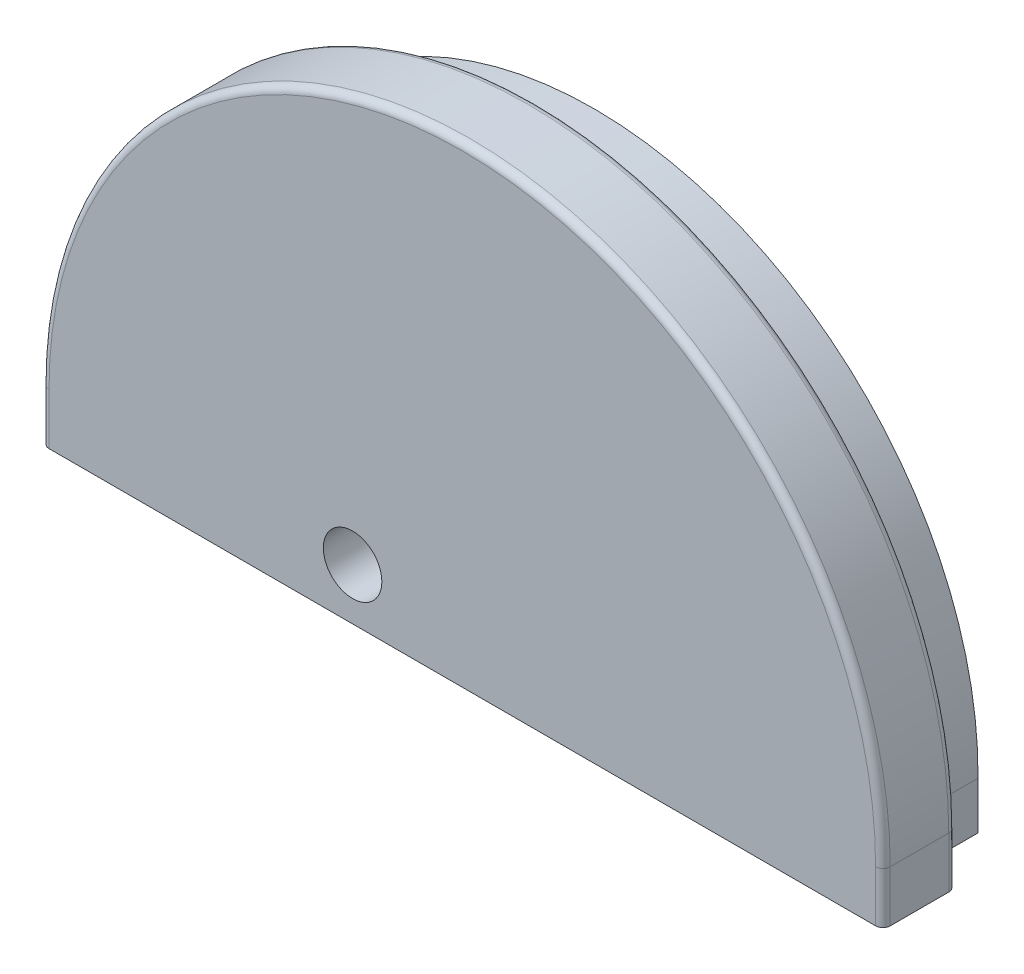
ISO-10303-21;
HEADER;
FILE_DESCRIPTION(('STEP AP214'),'2;1');
FILE_NAME('part.step','',(''),(''),'','','');
FILE_SCHEMA(('AUTOMOTIVE_DESIGN { 1 0 10303 214 1 1 1 1 }'));
ENDSEC;
DATA;
#1=APPLICATION_CONTEXT('core data for automotive mechanical design processes');
#2=APPLICATION_PROTOCOL_DEFINITION('international standard','automotive_design',2000,#1);
#3=PRODUCT_CONTEXT('',#1,'mechanical');
#4=PRODUCT('Part','Part','',(#3));
#5=PRODUCT_RELATED_PRODUCT_CATEGORY('part','',(#4));
#6=PRODUCT_DEFINITION_FORMATION('','',#4);
#7=PRODUCT_DEFINITION_CONTEXT('part definition',#1,'design');
#8=PRODUCT_DEFINITION('design','',#6,#7);
#9=PRODUCT_DEFINITION_SHAPE('','',#8);
#10=(LENGTH_UNIT() NAMED_UNIT(*) SI_UNIT(.MILLI.,.METRE.));
#11=(NAMED_UNIT(*) PLANE_ANGLE_UNIT() SI_UNIT($,.RADIAN.));
#12=(NAMED_UNIT(*) SI_UNIT($,.STERADIAN.) SOLID_ANGLE_UNIT());
#13=UNCERTAINTY_MEASURE_WITH_UNIT(LENGTH_MEASURE(1.E-05),#10,'distance_accuracy_value','');
#14=(GEOMETRIC_REPRESENTATION_CONTEXT(3) GLOBAL_UNCERTAINTY_ASSIGNED_CONTEXT((#13)) GLOBAL_UNIT_ASSIGNED_CONTEXT((#10,
#11,#12)) REPRESENTATION_CONTEXT('',''));
#15=CARTESIAN_POINT('',(0.,0.,0.));
#16=DIRECTION('',(0.,0.,1.));
#17=DIRECTION('',(1.,0.,0.));
#18=AXIS2_PLACEMENT_3D('',#15,#16,#17);
#19=CARTESIAN_POINT('',(49.7401472728543,48.7881442927304,8.));
#20=DIRECTION('',(0.,1.,0.));
#21=DIRECTION('',(0.,0.,1.));
#22=AXIS2_PLACEMENT_3D('',#19,#20,#21);
#23=PLANE('',#22);
#24=DIRECTION('',(0.,0.,-1.));
#25=VECTOR('',#24,1.);
#26=CARTESIAN_POINT('',(72.3917820401487,48.7881442927304,4.5));
#27=LINE('',#26,#25);
#28=CARTESIAN_POINT('',(72.3917820401487,48.7881442927304,2.5));
#29=VERTEX_POINT('',#28);
#30=CARTESIAN_POINT('',(72.3917820401487,48.7881442927304,2.));
#31=VERTEX_POINT('',#30);
#32=EDGE_CURVE('E356',#29,#31,#27,.T.);
#33=ORIENTED_EDGE('',*,*,#32,.T.);
#34=CARTESIAN_POINT('',(74.3917820401487,48.7881442927304,2.));
#35=DIRECTION('',(0.,1.,0.));
#36=DIRECTION('',(0.,0.,1.));
#37=AXIS2_PLACEMENT_3D('',#34,#35,#36);
#38=CIRCLE('',#37,2.);
#39=CARTESIAN_POINT('',(74.3917820401487,48.7881442927304,0.));
#40=VERTEX_POINT('',#39);
#41=EDGE_CURVE('E315',#31,#40,#38,.F.);
#42=ORIENTED_EDGE('',*,*,#41,.T.);
#43=DIRECTION('',(1.,0.,0.));
#44=VECTOR('',#43,1.);
#45=CARTESIAN_POINT('',(49.7401472728543,48.7881442927304,0.));
#46=LINE('',#45,#44);
#47=CARTESIAN_POINT('',(154.737534778382,48.7881442927304,0.));
#48=VERTEX_POINT('',#47);
#49=EDGE_CURVE('E214',#40,#48,#46,.T.);
#50=ORIENTED_EDGE('',*,*,#49,.T.);
#51=DIRECTION('',(0.,0.,-1.));
#52=VECTOR('',#51,1.);
#53=CARTESIAN_POINT('',(154.737534778382,48.7881442927304,8.));
#54=LINE('',#53,#52);
#55=CARTESIAN_POINT('',(154.737534778382,48.7881442927304,8.));
#56=VERTEX_POINT('',#55);
#57=EDGE_CURVE('E222',#56,#48,#54,.T.);
#58=ORIENTED_EDGE('',*,*,#57,.F.);
#59=DIRECTION('',(1.,0.,0.));
#60=VECTOR('',#59,1.);
#61=CARTESIAN_POINT('',(159.740147272854,48.7881442927297,8.));
#62=LINE('',#61,#60);
#63=CARTESIAN_POINT('',(158.740147272854,48.7881442927297,8.));
#64=VERTEX_POINT('',#63);
#65=EDGE_CURVE('E184',#56,#64,#62,.T.);
#66=ORIENTED_EDGE('',*,*,#65,.T.);
#67=CARTESIAN_POINT('',(158.740147272854,48.7881442927304,9.));
#68=DIRECTION('',(0.,1.,0.));
#69=DIRECTION('',(0.,0.,1.));
#70=AXIS2_PLACEMENT_3D('',#67,#68,#69);
#71=CIRCLE('',#70,1.);
#72=CARTESIAN_POINT('',(159.740147272854,48.7881442927297,9.));
#73=VERTEX_POINT('',#72);
#74=EDGE_CURVE('E637',#64,#73,#71,.F.);
#75=ORIENTED_EDGE('',*,*,#74,.T.);
#76=DIRECTION('',(0.,0.,-1.));
#77=VECTOR('',#76,1.);
#78=CARTESIAN_POINT('',(159.740147272854,48.7881442927297,18.));
#79=LINE('',#78,#77);
#80=CARTESIAN_POINT('',(159.740147272854,48.7881442927297,17.));
#81=VERTEX_POINT('',#80);
#82=EDGE_CURVE('E253',#81,#73,#79,.T.);
#83=ORIENTED_EDGE('',*,*,#82,.F.);
#84=CARTESIAN_POINT('',(158.740147272854,48.7881442927304,17.));
#85=DIRECTION('',(0.,1.,0.));
#86=DIRECTION('',(0.,0.,1.));
#87=AXIS2_PLACEMENT_3D('',#84,#85,#86);
#88=CIRCLE('',#87,1.);
#89=CARTESIAN_POINT('',(158.740147272854,48.7881442927297,18.));
#90=VERTEX_POINT('',#89);
#91=EDGE_CURVE('E278',#81,#90,#88,.F.);
#92=ORIENTED_EDGE('',*,*,#91,.T.);
#93=DIRECTION('',(1.,0.,0.));
#94=VECTOR('',#93,1.);
#95=CARTESIAN_POINT('',(159.740147272854,48.7881442927297,18.));
#96=LINE('',#95,#94);
#97=CARTESIAN_POINT('',(45.7401472728544,48.7881442927297,18.));
#98=VERTEX_POINT('',#97);
#99=EDGE_CURVE('E183',#98,#90,#96,.T.);
#100=ORIENTED_EDGE('',*,*,#99,.F.);
#101=CARTESIAN_POINT('',(45.7401472728544,48.7881442927304,17.));
#102=DIRECTION('',(0.,1.,0.));
#103=DIRECTION('',(0.,0.,1.));
#104=AXIS2_PLACEMENT_3D('',#101,#102,#103);
#105=CIRCLE('',#104,1.);
#106=CARTESIAN_POINT('',(44.7401472728544,48.7881442927297,17.));
#107=VERTEX_POINT('',#106);
#108=EDGE_CURVE('E652',#98,#107,#105,.F.);
#109=ORIENTED_EDGE('',*,*,#108,.T.);
#110=DIRECTION('',(0.,0.,-1.));
#111=VECTOR('',#110,1.);
#112=CARTESIAN_POINT('',(44.7401472728544,48.7881442927297,18.));
#113=LINE('',#112,#111);
#114=CARTESIAN_POINT('',(44.7401472728544,48.7881442927297,9.));
#115=VERTEX_POINT('',#114);
#116=EDGE_CURVE('E251',#107,#115,#113,.T.);
#117=ORIENTED_EDGE('',*,*,#116,.T.);
#118=CARTESIAN_POINT('',(45.7401472728544,48.7881442927304,9.));
#119=DIRECTION('',(0.,1.,0.));
#120=DIRECTION('',(0.,0.,1.));
#121=AXIS2_PLACEMENT_3D('',#118,#119,#120);
#122=CIRCLE('',#121,1.);
#123=CARTESIAN_POINT('',(45.7401472728544,48.7881442927297,8.));
#124=VERTEX_POINT('',#123);
#125=EDGE_CURVE('E179',#115,#124,#122,.F.);
#126=ORIENTED_EDGE('',*,*,#125,.T.);
#127=CARTESIAN_POINT('',(49.7401472728543,48.7881442927297,8.));
#128=VERTEX_POINT('',#127);
#129=EDGE_CURVE('E171',#124,#128,#62,.T.);
#130=ORIENTED_EDGE('',*,*,#129,.T.);
#131=DIRECTION('',(0.,0.,-1.));
#132=VECTOR('',#131,1.);
#133=CARTESIAN_POINT('',(49.7401472728543,48.7881442927304,8.));
#134=LINE('',#133,#132);
#135=CARTESIAN_POINT('',(49.7401472728543,48.7881442927304,0.));
#136=VERTEX_POINT('',#135);
#137=EDGE_CURVE('E175',#128,#136,#134,.T.);
#138=ORIENTED_EDGE('',*,*,#137,.T.);
#139=CARTESIAN_POINT('',(55.3917820401487,48.7881442927304,0.));
#140=VERTEX_POINT('',#139);
#141=EDGE_CURVE('E211',#136,#140,#46,.T.);
#142=ORIENTED_EDGE('',*,*,#141,.T.);
#143=CARTESIAN_POINT('',(55.3917820401487,48.7881442927304,2.));
#144=DIRECTION('',(0.,1.,0.));
#145=DIRECTION('',(0.,0.,1.));
#146=AXIS2_PLACEMENT_3D('',#143,#144,#145);
#147=CIRCLE('',#146,2.);
#148=CARTESIAN_POINT('',(57.3917820401487,48.7881442927304,2.));
#149=VERTEX_POINT('',#148);
#150=EDGE_CURVE('E313',#140,#149,#147,.F.);
#151=ORIENTED_EDGE('',*,*,#150,.T.);
#152=DIRECTION('',(0.,0.,-1.));
#153=VECTOR('',#152,1.);
#154=CARTESIAN_POINT('',(57.3917820401487,48.7881442927304,4.5));
#155=LINE('',#154,#153);
#156=CARTESIAN_POINT('',(57.3917820401487,48.7881442927304,2.5));
#157=VERTEX_POINT('',#156);
#158=EDGE_CURVE('E360',#157,#149,#155,.T.);
#159=ORIENTED_EDGE('',*,*,#158,.F.);
#160=CARTESIAN_POINT('',(59.3917820401487,48.7881442927304,2.5));
#161=DIRECTION('',(0.,1.,0.));
#162=DIRECTION('',(0.,0.,1.));
#163=AXIS2_PLACEMENT_3D('',#160,#161,#162);
#164=CIRCLE('',#163,2.);
#165=CARTESIAN_POINT('',(59.3917820401487,48.7881442927304,4.5));
#166=VERTEX_POINT('',#165);
#167=EDGE_CURVE('E43',#157,#166,#164,.T.);
#168=ORIENTED_EDGE('',*,*,#167,.T.);
#169=DIRECTION('',(1.,0.,0.));
#170=VECTOR('',#169,1.);
#171=CARTESIAN_POINT('',(72.3917820401487,48.7881442927304,4.5));
#172=LINE('',#171,#170);
#173=CARTESIAN_POINT('',(70.3917820401487,48.7881442927304,4.5));
#174=VERTEX_POINT('',#173);
#175=EDGE_CURVE('E335',#166,#174,#172,.T.);
#176=ORIENTED_EDGE('',*,*,#175,.T.);
#177=CARTESIAN_POINT('',(70.3917820401487,48.7881442927304,2.5));
#178=DIRECTION('',(0.,1.,0.));
#179=DIRECTION('',(0.,0.,1.));
#180=AXIS2_PLACEMENT_3D('',#177,#178,#179);
#181=CIRCLE('',#180,2.);
#182=EDGE_CURVE('E11',#174,#29,#181,.T.);
#183=ORIENTED_EDGE('',*,*,#182,.T.);
#184=EDGE_LOOP('',(#33,#42,#50,#58,#66,#75,#83,#92,#100,#109,#117,#126,#130,#138,#142,#151,#159,
#168,#176,#183));
#185=FACE_BOUND('',#184,.T.);
#186=ADVANCED_FACE('F34',(#185),#23,.F.);
#187=CARTESIAN_POINT('',(102.240147272854,55.7881442927283,0.));
#188=DIRECTION('',(0.,0.,-1.));
#189=DIRECTION('',(-1.,0.,0.));
#190=AXIS2_PLACEMENT_3D('',#187,#188,#189);
#191=PLANE('',#190);
#192=ORIENTED_EDGE('',*,*,#49,.F.);
#193=DIRECTION('',(0.,1.,0.));
#194=VECTOR('',#193,1.);
#195=CARTESIAN_POINT('',(74.3917820401487,55.7881442927283,0.));
#196=LINE('',#195,#194);
#197=CARTESIAN_POINT('',(74.3917820401487,58.7546680660623,0.));
#198=VERTEX_POINT('',#197);
#199=EDGE_CURVE('E306',#40,#198,#196,.T.);
#200=ORIENTED_EDGE('',*,*,#199,.T.);
#201=CARTESIAN_POINT('',(64.8917820401487,58.7546680660623,0.));
#202=DIRECTION('',(0.,0.,-1.));
#203=DIRECTION('',(-1.,0.,0.));
#204=AXIS2_PLACEMENT_3D('',#201,#202,#203);
#205=CIRCLE('',#204,9.49999999999998);
#206=CARTESIAN_POINT('',(55.3917820401487,58.7546680660623,0.));
#207=VERTEX_POINT('',#206);
#208=EDGE_CURVE('E291',#198,#207,#205,.F.);
#209=ORIENTED_EDGE('',*,*,#208,.T.);
#210=DIRECTION('',(0.,-1.,0.));
#211=VECTOR('',#210,1.);
#212=CARTESIAN_POINT('',(55.3917820401487,55.7881442927283,0.));
#213=LINE('',#212,#211);
#214=EDGE_CURVE('E304',#207,#140,#213,.T.);
#215=ORIENTED_EDGE('',*,*,#214,.T.);
#216=ORIENTED_EDGE('',*,*,#141,.F.);
#217=DIRECTION('',(0.,-1.,0.));
#218=VECTOR('',#217,1.);
#219=CARTESIAN_POINT('',(49.7401472728543,55.7881442927283,0.));
#220=LINE('',#219,#218);
#221=CARTESIAN_POINT('',(49.7401472728543,55.7881442927283,0.));
#222=VERTEX_POINT('',#221);
#223=EDGE_CURVE('E193',#222,#136,#220,.T.);
#224=ORIENTED_EDGE('',*,*,#223,.F.);
#225=CARTESIAN_POINT('',(102.240147272854,55.7881442927283,0.));
#226=DIRECTION('',(0.,0.,1.));
#227=DIRECTION('',(-1.,0.,0.));
#228=AXIS2_PLACEMENT_3D('',#225,#226,#227);
#229=CIRCLE('',#228,52.5);
#230=CARTESIAN_POINT('',(154.737534778382,55.2644028541581,0.));
#231=VERTEX_POINT('',#230);
#232=EDGE_CURVE('E216',#231,#222,#229,.T.);
#233=ORIENTED_EDGE('',*,*,#232,.F.);
#234=DIRECTION('',(0.,1.,0.));
#235=VECTOR('',#234,1.);
#236=CARTESIAN_POINT('',(154.737534778382,48.7881442927304,0.));
#237=LINE('',#236,#235);
#238=EDGE_CURVE('E213',#48,#231,#237,.T.);
#239=ORIENTED_EDGE('',*,*,#238,.F.);
#240=EDGE_LOOP('',(#192,#200,#209,#215,#216,#224,#233,#239));
#241=FACE_BOUND('',#240,.T.);
#242=CARTESIAN_POINT('',(87.2401472728543,55.7881442927304,0.));
#243=DIRECTION('',(0.,0.,-1.));
#244=DIRECTION('',(-1.,0.,0.));
#245=AXIS2_PLACEMENT_3D('',#242,#243,#244);
#246=CIRCLE('',#245,4.00000000000001);
#247=CARTESIAN_POINT('',(83.2401472728543,55.7881442927304,0.));
#248=VERTEX_POINT('',#247);
#249=EDGE_CURVE('E298',#248,#248,#246,.F.);
#250=ORIENTED_EDGE('',*,*,#249,.T.);
#251=EDGE_LOOP('',(#250));
#252=FACE_BOUND('',#251,.T.);
#253=ADVANCED_FACE('F369',(#241,#252),#191,.T.);
#254=CARTESIAN_POINT('',(154.737534778382,48.7881442927304,8.));
#255=DIRECTION('',(-1.,0.,0.));
#256=DIRECTION('',(0.,0.,1.));
#257=AXIS2_PLACEMENT_3D('',#254,#255,#256);
#258=PLANE('',#257);
#259=ORIENTED_EDGE('',*,*,#238,.T.);
#260=DIRECTION('',(0.,0.,-1.));
#261=VECTOR('',#260,1.);
#262=CARTESIAN_POINT('',(154.737534778382,55.2644028541581,8.));
#263=LINE('',#262,#261);
#264=CARTESIAN_POINT('',(154.737534778382,55.2644028541581,8.));
#265=VERTEX_POINT('',#264);
#266=EDGE_CURVE('E220',#265,#231,#263,.T.);
#267=ORIENTED_EDGE('',*,*,#266,.F.);
#268=DIRECTION('',(0.,1.,0.));
#269=VECTOR('',#268,1.);
#270=CARTESIAN_POINT('',(154.737534778382,48.7881442927304,8.));
#271=LINE('',#270,#269);
#272=EDGE_CURVE('E201',#56,#265,#271,.T.);
#273=ORIENTED_EDGE('',*,*,#272,.F.);
#274=ORIENTED_EDGE('',*,*,#57,.T.);
#275=EDGE_LOOP('',(#259,#267,#273,#274));
#276=FACE_BOUND('',#275,.T.);
#277=ADVANCED_FACE('F391',(#276),#258,.F.);
#278=CARTESIAN_POINT('',(102.240147272854,55.7881442927283,8.));
#279=DIRECTION('',(0.,0.,-1.));
#280=DIRECTION('',(-1.,0.,0.));
#281=AXIS2_PLACEMENT_3D('',#278,#279,#280);
#282=CYLINDRICAL_SURFACE('',#281,52.5);
#283=ORIENTED_EDGE('',*,*,#232,.T.);
#284=DIRECTION('',(0.,0.,-1.));
#285=VECTOR('',#284,1.);
#286=CARTESIAN_POINT('',(49.7401472728543,55.7881442927283,8.));
#287=LINE('',#286,#285);
#288=CARTESIAN_POINT('',(49.7401472728543,55.7881442927283,8.));
#289=VERTEX_POINT('',#288);
#290=EDGE_CURVE('E194',#289,#222,#287,.T.);
#291=ORIENTED_EDGE('',*,*,#290,.F.);
#292=CARTESIAN_POINT('',(102.240147272854,55.7881442927283,8.));
#293=DIRECTION('',(0.,0.,1.));
#294=DIRECTION('',(-1.,0.,0.));
#295=AXIS2_PLACEMENT_3D('',#292,#293,#294);
#296=CIRCLE('',#295,52.5);
#297=EDGE_CURVE('E199',#265,#289,#296,.T.);
#298=ORIENTED_EDGE('',*,*,#297,.F.);
#299=ORIENTED_EDGE('',*,*,#266,.T.);
#300=EDGE_LOOP('',(#283,#291,#298,#299));
#301=FACE_BOUND('',#300,.T.);
#302=ADVANCED_FACE('F554',(#301),#282,.T.);
#303=CARTESIAN_POINT('',(49.7401472728543,55.7881442927283,8.));
#304=DIRECTION('',(1.,0.,0.));
#305=DIRECTION('',(0.,0.,-1.));
#306=AXIS2_PLACEMENT_3D('',#303,#304,#305);
#307=PLANE('',#306);
#308=ORIENTED_EDGE('',*,*,#223,.T.);
#309=ORIENTED_EDGE('',*,*,#137,.F.);
#310=DIRECTION('',(0.,-1.,0.));
#311=VECTOR('',#310,1.);
#312=CARTESIAN_POINT('',(49.7401472728543,55.7881442927283,8.));
#313=LINE('',#312,#311);
#314=EDGE_CURVE('E190',#289,#128,#313,.T.);
#315=ORIENTED_EDGE('',*,*,#314,.F.);
#316=ORIENTED_EDGE('',*,*,#290,.T.);
#317=EDGE_LOOP('',(#308,#309,#315,#316));
#318=FACE_BOUND('',#317,.T.);
#319=ADVANCED_FACE('F188',(#318),#307,.F.);
#320=CARTESIAN_POINT('',(44.7401472728544,55.7881442927304,18.));
#321=DIRECTION('',(1.,0.,0.));
#322=DIRECTION('',(0.,0.,-1.));
#323=AXIS2_PLACEMENT_3D('',#320,#321,#322);
#324=PLANE('',#323);
#325=DIRECTION('',(0.,0.,-1.));
#326=VECTOR('',#325,1.);
#327=CARTESIAN_POINT('',(44.7401472728544,55.7881442927304,18.));
#328=LINE('',#327,#326);
#329=CARTESIAN_POINT('',(44.7401472728544,55.7881442927304,17.));
#330=VERTEX_POINT('',#329);
#331=CARTESIAN_POINT('',(44.7401472728544,55.7881442927304,9.));
#332=VERTEX_POINT('',#331);
#333=EDGE_CURVE('E245',#330,#332,#328,.T.);
#334=ORIENTED_EDGE('',*,*,#333,.T.);
#335=DIRECTION('',(0.,-1.,0.));
#336=VECTOR('',#335,1.);
#337=CARTESIAN_POINT('',(44.7401472728544,48.7881442927297,9.));
#338=LINE('',#337,#336);
#339=EDGE_CURVE('E644',#332,#115,#338,.T.);
#340=ORIENTED_EDGE('',*,*,#339,.T.);
#341=ORIENTED_EDGE('',*,*,#116,.F.);
#342=DIRECTION('',(0.,-1.,0.));
#343=VECTOR('',#342,1.);
#344=CARTESIAN_POINT('',(44.7401472728544,55.7881442927304,17.));
#345=LINE('',#344,#343);
#346=EDGE_CURVE('E642',#107,#330,#345,.F.);
#347=ORIENTED_EDGE('',*,*,#346,.T.);
#348=EDGE_LOOP('',(#334,#340,#341,#347));
#349=FACE_BOUND('',#348,.T.);
#350=ADVANCED_FACE('F533',(#349),#324,.F.);
#351=CARTESIAN_POINT('',(159.740147272854,55.7881442927304,18.));
#352=DIRECTION('',(-1.,0.,0.));
#353=DIRECTION('',(0.,0.,1.));
#354=AXIS2_PLACEMENT_3D('',#351,#352,#353);
#355=PLANE('',#354);
#356=ORIENTED_EDGE('',*,*,#82,.T.);
#357=DIRECTION('',(0.,1.,0.));
#358=VECTOR('',#357,1.);
#359=CARTESIAN_POINT('',(159.740147272854,55.7881442927304,9.));
#360=LINE('',#359,#358);
#361=CARTESIAN_POINT('',(159.740147272854,55.7881442927304,9.));
#362=VERTEX_POINT('',#361);
#363=EDGE_CURVE('E230',#73,#362,#360,.T.);
#364=ORIENTED_EDGE('',*,*,#363,.T.);
#365=DIRECTION('',(0.,0.,-1.));
#366=VECTOR('',#365,1.);
#367=CARTESIAN_POINT('',(159.740147272854,55.7881442927304,18.));
#368=LINE('',#367,#366);
#369=CARTESIAN_POINT('',(159.740147272854,55.7881442927304,17.));
#370=VERTEX_POINT('',#369);
#371=EDGE_CURVE('E255',#370,#362,#368,.T.);
#372=ORIENTED_EDGE('',*,*,#371,.F.);
#373=DIRECTION('',(0.,1.,0.));
#374=VECTOR('',#373,1.);
#375=CARTESIAN_POINT('',(159.740147272854,55.7881442927304,17.));
#376=LINE('',#375,#374);
#377=EDGE_CURVE('E226',#370,#81,#376,.F.);
#378=ORIENTED_EDGE('',*,*,#377,.T.);
#379=EDGE_LOOP('',(#356,#364,#372,#378));
#380=FACE_BOUND('',#379,.T.);
#381=ADVANCED_FACE('F524',(#380),#355,.F.);
#382=CARTESIAN_POINT('',(102.240147272854,55.7881442927304,18.));
#383=DIRECTION('',(0.,0.,-1.));
#384=DIRECTION('',(-1.,0.,0.));
#385=AXIS2_PLACEMENT_3D('',#382,#383,#384);
#386=CYLINDRICAL_SURFACE('',#385,57.5);
#387=ORIENTED_EDGE('',*,*,#371,.T.);
#388=CARTESIAN_POINT('',(102.240147272854,55.7881442927304,9.));
#389=DIRECTION('',(0.,0.,-1.));
#390=DIRECTION('',(-1.,0.,0.));
#391=AXIS2_PLACEMENT_3D('',#388,#389,#390);
#392=CIRCLE('',#391,57.5);
#393=EDGE_CURVE('E284',#362,#332,#392,.F.);
#394=ORIENTED_EDGE('',*,*,#393,.T.);
#395=ORIENTED_EDGE('',*,*,#333,.F.);
#396=CARTESIAN_POINT('',(102.240147272854,55.7881442927304,17.));
#397=DIRECTION('',(0.,0.,-1.));
#398=DIRECTION('',(-1.,0.,0.));
#399=AXIS2_PLACEMENT_3D('',#396,#397,#398);
#400=CIRCLE('',#399,57.5);
#401=EDGE_CURVE('E282',#330,#370,#400,.T.);
#402=ORIENTED_EDGE('',*,*,#401,.T.);
#403=EDGE_LOOP('',(#387,#394,#395,#402));
#404=FACE_BOUND('',#403,.T.);
#405=ADVANCED_FACE('F516',(#404),#386,.T.);
#406=CARTESIAN_POINT('',(102.240147272854,55.7881442927304,18.));
#407=DIRECTION('',(0.,0.,-1.));
#408=DIRECTION('',(-1.,0.,0.));
#409=AXIS2_PLACEMENT_3D('',#406,#407,#408);
#410=PLANE('',#409);
#411=ORIENTED_EDGE('',*,*,#99,.T.);
#412=DIRECTION('',(0.,1.,0.));
#413=VECTOR('',#412,1.);
#414=CARTESIAN_POINT('',(158.740147272854,55.7881442927304,18.));
#415=LINE('',#414,#413);
#416=CARTESIAN_POINT('',(158.740147272854,55.7881442927304,18.));
#417=VERTEX_POINT('',#416);
#418=EDGE_CURVE('E270',#90,#417,#415,.T.);
#419=ORIENTED_EDGE('',*,*,#418,.T.);
#420=CARTESIAN_POINT('',(102.240147272854,55.7881442927304,18.));
#421=DIRECTION('',(0.,0.,-1.));
#422=DIRECTION('',(-1.,0.,0.));
#423=AXIS2_PLACEMENT_3D('',#420,#421,#422);
#424=CIRCLE('',#423,56.5);
#425=CARTESIAN_POINT('',(45.7401472728544,55.7881442927304,18.));
#426=VERTEX_POINT('',#425);
#427=EDGE_CURVE('E286',#417,#426,#424,.F.);
#428=ORIENTED_EDGE('',*,*,#427,.T.);
#429=DIRECTION('',(0.,-1.,0.));
#430=VECTOR('',#429,1.);
#431=CARTESIAN_POINT('',(45.7401472728544,55.7881442927304,18.));
#432=LINE('',#431,#430);
#433=EDGE_CURVE('E272',#426,#98,#432,.T.);
#434=ORIENTED_EDGE('',*,*,#433,.T.);
#435=EDGE_LOOP('',(#411,#419,#428,#434));
#436=FACE_BOUND('',#435,.T.);
#437=CARTESIAN_POINT('',(87.2401472728543,55.7881442927304,18.));
#438=DIRECTION('',(0.,0.,1.));
#439=DIRECTION('',(1.,0.,0.));
#440=AXIS2_PLACEMENT_3D('',#437,#438,#439);
#441=CIRCLE('',#440,4.00000000000001);
#442=CARTESIAN_POINT('',(91.2401472728543,55.7881442927304,18.));
#443=VERTEX_POINT('',#442);
#444=EDGE_CURVE('E250',#443,#443,#441,.T.);
#445=ORIENTED_EDGE('',*,*,#444,.F.);
#446=EDGE_LOOP('',(#445));
#447=FACE_BOUND('',#446,.T.);
#448=ADVANCED_FACE('F268',(#436,#447),#410,.F.);
#449=CARTESIAN_POINT('',(102.240147272854,55.7881442927304,8.));
#450=DIRECTION('',(0.,0.,-1.));
#451=DIRECTION('',(-1.,0.,0.));
#452=AXIS2_PLACEMENT_3D('',#449,#450,#451);
#453=PLANE('',#452);
#454=CARTESIAN_POINT('',(102.240147272854,55.7881442927304,8.));
#455=DIRECTION('',(0.,0.,-1.));
#456=DIRECTION('',(-1.,0.,0.));
#457=AXIS2_PLACEMENT_3D('',#454,#455,#456);
#458=CIRCLE('',#457,56.5);
#459=CARTESIAN_POINT('',(45.7401472728544,55.7881442927304,8.));
#460=VERTEX_POINT('',#459);
#461=CARTESIAN_POINT('',(158.740147272854,55.7881442927304,8.));
#462=VERTEX_POINT('',#461);
#463=EDGE_CURVE('E237',#460,#462,#458,.T.);
#464=ORIENTED_EDGE('',*,*,#463,.T.);
#465=DIRECTION('',(0.,1.,0.));
#466=VECTOR('',#465,1.);
#467=CARTESIAN_POINT('',(158.740147272854,48.7881442927297,8.));
#468=LINE('',#467,#466);
#469=EDGE_CURVE('E640',#462,#64,#468,.F.);
#470=ORIENTED_EDGE('',*,*,#469,.T.);
#471=ORIENTED_EDGE('',*,*,#65,.F.);
#472=ORIENTED_EDGE('',*,*,#272,.T.);
#473=ORIENTED_EDGE('',*,*,#297,.T.);
#474=ORIENTED_EDGE('',*,*,#314,.T.);
#475=ORIENTED_EDGE('',*,*,#129,.F.);
#476=DIRECTION('',(0.,-1.,0.));
#477=VECTOR('',#476,1.);
#478=CARTESIAN_POINT('',(45.7401472728544,55.7881442927304,8.));
#479=LINE('',#478,#477);
#480=EDGE_CURVE('E655',#124,#460,#479,.F.);
#481=ORIENTED_EDGE('',*,*,#480,.T.);
#482=EDGE_LOOP('',(#464,#470,#471,#472,#473,#474,#475,#481));
#483=FACE_BOUND('',#482,.T.);
#484=ADVANCED_FACE('F196',(#483),#453,.T.);
#485=CARTESIAN_POINT('',(87.2401472728543,55.7881442927304,-500000.));
#486=DIRECTION('',(0.,0.,1.));
#487=DIRECTION('',(1.,0.,0.));
#488=AXIS2_PLACEMENT_3D('',#485,#486,#487);
#489=CYLINDRICAL_SURFACE('',#488,4.00000000000001);
#490=ORIENTED_EDGE('',*,*,#444,.T.);
#491=EDGE_LOOP('',(#490));
#492=FACE_BOUND('',#491,.T.);
#493=ORIENTED_EDGE('',*,*,#249,.F.);
#494=EDGE_LOOP('',(#493));
#495=FACE_BOUND('',#494,.T.);
#496=ADVANCED_FACE('F371',(#492,#495),#489,.F.);
#497=CARTESIAN_POINT('',(45.7401472728544,55.7881442927304,9.));
#498=DIRECTION('',(0.,1.,0.));
#499=DIRECTION('',(0.,0.,1.));
#500=AXIS2_PLACEMENT_3D('',#497,#498,#499);
#501=CYLINDRICAL_SURFACE('',#500,1.);
#502=ORIENTED_EDGE('',*,*,#125,.F.);
#503=ORIENTED_EDGE('',*,*,#339,.F.);
#504=CARTESIAN_POINT('',(45.7401472728544,55.7881442927304,9.));
#505=DIRECTION('',(0.,1.,0.));
#506=DIRECTION('',(0.,0.,1.));
#507=AXIS2_PLACEMENT_3D('',#504,#505,#506);
#508=CIRCLE('',#507,1.);
#509=EDGE_CURVE('E294',#460,#332,#508,.T.);
#510=ORIENTED_EDGE('',*,*,#509,.F.);
#511=ORIENTED_EDGE('',*,*,#480,.F.);
#512=EDGE_LOOP('',(#502,#503,#510,#511));
#513=FACE_BOUND('',#512,.T.);
#514=ADVANCED_FACE('F373',(#513),#501,.T.);
#515=CARTESIAN_POINT('',(102.240147272854,55.7881442927304,9.));
#516=DIRECTION('',(0.,0.,-1.));
#517=DIRECTION('',(-1.,0.,0.));
#518=AXIS2_PLACEMENT_3D('',#515,#516,#517);
#519=TOROIDAL_SURFACE('',#518,56.5,1.);
#520=ORIENTED_EDGE('',*,*,#509,.T.);
#521=ORIENTED_EDGE('',*,*,#393,.F.);
#522=CARTESIAN_POINT('',(158.740147272854,55.7881442927304,9.));
#523=DIRECTION('',(0.,-1.,0.));
#524=DIRECTION('',(0.,0.,-1.));
#525=AXIS2_PLACEMENT_3D('',#522,#523,#524);
#526=CIRCLE('',#525,1.);
#527=EDGE_CURVE('E292',#462,#362,#526,.T.);
#528=ORIENTED_EDGE('',*,*,#527,.F.);
#529=ORIENTED_EDGE('',*,*,#463,.F.);
#530=EDGE_LOOP('',(#520,#521,#528,#529));
#531=FACE_BOUND('',#530,.T.);
#532=ADVANCED_FACE('F380',(#531),#519,.T.);
#533=CARTESIAN_POINT('',(158.740147272854,55.7881442927304,9.));
#534=DIRECTION('',(0.,-1.,0.));
#535=DIRECTION('',(0.,0.,-1.));
#536=AXIS2_PLACEMENT_3D('',#533,#534,#535);
#537=CYLINDRICAL_SURFACE('',#536,1.);
#538=ORIENTED_EDGE('',*,*,#74,.F.);
#539=ORIENTED_EDGE('',*,*,#469,.F.);
#540=ORIENTED_EDGE('',*,*,#527,.T.);
#541=ORIENTED_EDGE('',*,*,#363,.F.);
#542=EDGE_LOOP('',(#538,#539,#540,#541));
#543=FACE_BOUND('',#542,.T.);
#544=ADVANCED_FACE('F397',(#543),#537,.T.);
#545=CARTESIAN_POINT('',(45.7401472728544,55.7881442927304,17.));
#546=DIRECTION('',(0.,-1.,0.));
#547=DIRECTION('',(0.,0.,-1.));
#548=AXIS2_PLACEMENT_3D('',#545,#546,#547);
#549=CYLINDRICAL_SURFACE('',#548,1.);
#550=ORIENTED_EDGE('',*,*,#108,.F.);
#551=ORIENTED_EDGE('',*,*,#433,.F.);
#552=CARTESIAN_POINT('',(45.7401472728544,55.7881442927304,17.));
#553=DIRECTION('',(0.,1.,0.));
#554=DIRECTION('',(0.,0.,1.));
#555=AXIS2_PLACEMENT_3D('',#552,#553,#554);
#556=CIRCLE('',#555,1.);
#557=EDGE_CURVE('E295',#330,#426,#556,.T.);
#558=ORIENTED_EDGE('',*,*,#557,.F.);
#559=ORIENTED_EDGE('',*,*,#346,.F.);
#560=EDGE_LOOP('',(#550,#551,#558,#559));
#561=FACE_BOUND('',#560,.T.);
#562=ADVANCED_FACE('F400',(#561),#549,.T.);
#563=CARTESIAN_POINT('',(102.240147272854,55.7881442927304,17.));
#564=DIRECTION('',(0.,0.,-1.));
#565=DIRECTION('',(-1.,0.,0.));
#566=AXIS2_PLACEMENT_3D('',#563,#564,#565);
#567=TOROIDAL_SURFACE('',#566,56.5,1.);
#568=ORIENTED_EDGE('',*,*,#557,.T.);
#569=ORIENTED_EDGE('',*,*,#427,.F.);
#570=CARTESIAN_POINT('',(158.740147272854,55.7881442927304,17.));
#571=DIRECTION('',(0.,-1.,0.));
#572=DIRECTION('',(0.,0.,-1.));
#573=AXIS2_PLACEMENT_3D('',#570,#571,#572);
#574=CIRCLE('',#573,1.);
#575=EDGE_CURVE('E280',#370,#417,#574,.T.);
#576=ORIENTED_EDGE('',*,*,#575,.F.);
#577=ORIENTED_EDGE('',*,*,#401,.F.);
#578=EDGE_LOOP('',(#568,#569,#576,#577));
#579=FACE_BOUND('',#578,.T.);
#580=ADVANCED_FACE('F408',(#579),#567,.T.);
#581=CARTESIAN_POINT('',(158.740147272854,55.7881442927304,17.));
#582=DIRECTION('',(0.,1.,0.));
#583=DIRECTION('',(0.,0.,1.));
#584=AXIS2_PLACEMENT_3D('',#581,#582,#583);
#585=CYLINDRICAL_SURFACE('',#584,1.);
#586=ORIENTED_EDGE('',*,*,#91,.F.);
#587=ORIENTED_EDGE('',*,*,#377,.F.);
#588=ORIENTED_EDGE('',*,*,#575,.T.);
#589=ORIENTED_EDGE('',*,*,#418,.F.);
#590=EDGE_LOOP('',(#586,#587,#588,#589));
#591=FACE_BOUND('',#590,.T.);
#592=ADVANCED_FACE('F276',(#591),#585,.T.);
#593=CARTESIAN_POINT('',(64.8917820401487,58.7546680660623,4.5));
#594=DIRECTION('',(0.,0.,-1.));
#595=DIRECTION('',(-1.,0.,0.));
#596=AXIS2_PLACEMENT_3D('',#593,#594,#595);
#597=CYLINDRICAL_SURFACE('',#596,7.49999999999998);
#598=DIRECTION('',(0.,0.,-1.));
#599=VECTOR('',#598,1.);
#600=CARTESIAN_POINT('',(72.3917820401487,58.7546680660623,4.5));
#601=LINE('',#600,#599);
#602=CARTESIAN_POINT('',(72.3917820401487,58.7546680660623,2.5));
#603=VERTEX_POINT('',#602);
#604=CARTESIAN_POINT('',(72.3917820401487,58.7546680660623,2.));
#605=VERTEX_POINT('',#604);
#606=EDGE_CURVE('E353',#603,#605,#601,.T.);
#607=ORIENTED_EDGE('',*,*,#606,.F.);
#608=CARTESIAN_POINT('',(64.8917820401487,58.7546680660623,2.5));
#609=DIRECTION('',(0.,0.,1.));
#610=DIRECTION('',(1.,0.,0.));
#611=AXIS2_PLACEMENT_3D('',#608,#609,#610);
#612=CIRCLE('',#611,7.49999999999998);
#613=CARTESIAN_POINT('',(57.3917820401487,58.7546680660623,2.5));
#614=VERTEX_POINT('',#613);
#615=EDGE_CURVE('E328',#603,#614,#612,.T.);
#616=ORIENTED_EDGE('',*,*,#615,.T.);
#617=DIRECTION('',(0.,0.,-1.));
#618=VECTOR('',#617,1.);
#619=CARTESIAN_POINT('',(57.3917820401487,58.7546680660623,4.5));
#620=LINE('',#619,#618);
#621=CARTESIAN_POINT('',(57.3917820401487,58.7546680660623,2.));
#622=VERTEX_POINT('',#621);
#623=EDGE_CURVE('E300',#614,#622,#620,.T.);
#624=ORIENTED_EDGE('',*,*,#623,.T.);
#625=CARTESIAN_POINT('',(64.8917820401487,58.7546680660623,2.));
#626=DIRECTION('',(0.,0.,-1.));
#627=DIRECTION('',(-1.,0.,0.));
#628=AXIS2_PLACEMENT_3D('',#625,#626,#627);
#629=CIRCLE('',#628,7.49999999999998);
#630=EDGE_CURVE('E326',#622,#605,#629,.T.);
#631=ORIENTED_EDGE('',*,*,#630,.T.);
#632=EDGE_LOOP('',(#607,#616,#624,#631));
#633=FACE_BOUND('',#632,.T.);
#634=ADVANCED_FACE('F407',(#633),#597,.F.);
#635=CARTESIAN_POINT('',(57.3917820401487,48.7881442927304,4.5));
#636=DIRECTION('',(1.,0.,0.));
#637=DIRECTION('',(0.,0.,-1.));
#638=AXIS2_PLACEMENT_3D('',#635,#636,#637);
#639=PLANE('',#638);
#640=ORIENTED_EDGE('',*,*,#158,.T.);
#641=DIRECTION('',(0.,-1.,0.));
#642=VECTOR('',#641,1.);
#643=CARTESIAN_POINT('',(57.3917820401487,48.7881442927304,2.));
#644=LINE('',#643,#642);
#645=EDGE_CURVE('E320',#149,#622,#644,.F.);
#646=ORIENTED_EDGE('',*,*,#645,.T.);
#647=ORIENTED_EDGE('',*,*,#623,.F.);
#648=DIRECTION('',(0.,-1.,0.));
#649=VECTOR('',#648,1.);
#650=CARTESIAN_POINT('',(57.3917820401487,48.7881442927304,2.5));
#651=LINE('',#650,#649);
#652=EDGE_CURVE('E317',#614,#157,#651,.T.);
#653=ORIENTED_EDGE('',*,*,#652,.T.);
#654=EDGE_LOOP('',(#640,#646,#647,#653));
#655=FACE_BOUND('',#654,.T.);
#656=ADVANCED_FACE('F460',(#655),#639,.T.);
#657=CARTESIAN_POINT('',(72.3917820401487,58.7546680660623,4.5));
#658=DIRECTION('',(-1.,0.,0.));
#659=DIRECTION('',(0.,0.,1.));
#660=AXIS2_PLACEMENT_3D('',#657,#658,#659);
#661=PLANE('',#660);
#662=ORIENTED_EDGE('',*,*,#606,.T.);
#663=DIRECTION('',(0.,1.,0.));
#664=VECTOR('',#663,1.);
#665=CARTESIAN_POINT('',(72.3917820401487,58.7546680660623,2.));
#666=LINE('',#665,#664);
#667=EDGE_CURVE('E311',#605,#31,#666,.F.);
#668=ORIENTED_EDGE('',*,*,#667,.T.);
#669=ORIENTED_EDGE('',*,*,#32,.F.);
#670=DIRECTION('',(0.,1.,0.));
#671=VECTOR('',#670,1.);
#672=CARTESIAN_POINT('',(72.3917820401487,58.7546680660623,2.5));
#673=LINE('',#672,#671);
#674=EDGE_CURVE('E309',#29,#603,#673,.T.);
#675=ORIENTED_EDGE('',*,*,#674,.T.);
#676=EDGE_LOOP('',(#662,#668,#669,#675));
#677=FACE_BOUND('',#676,.T.);
#678=ADVANCED_FACE('F453',(#677),#661,.T.);
#679=CARTESIAN_POINT('',(64.8917820401487,58.7546680660623,4.5));
#680=DIRECTION('',(0.,0.,1.));
#681=DIRECTION('',(1.,0.,0.));
#682=AXIS2_PLACEMENT_3D('',#679,#680,#681);
#683=PLANE('',#682);
#684=ORIENTED_EDGE('',*,*,#175,.F.);
#685=DIRECTION('',(0.,-1.,0.));
#686=VECTOR('',#685,1.);
#687=CARTESIAN_POINT('',(59.3917820401487,58.7546680660623,4.5));
#688=LINE('',#687,#686);
#689=CARTESIAN_POINT('',(59.3917820401487,58.7546680660623,4.5));
#690=VERTEX_POINT('',#689);
#691=EDGE_CURVE('E51',#166,#690,#688,.F.);
#692=ORIENTED_EDGE('',*,*,#691,.T.);
#693=CARTESIAN_POINT('',(64.8917820401487,58.7546680660623,4.5));
#694=DIRECTION('',(0.,0.,1.));
#695=DIRECTION('',(1.,0.,0.));
#696=AXIS2_PLACEMENT_3D('',#693,#694,#695);
#697=CIRCLE('',#696,5.49999999999998);
#698=CARTESIAN_POINT('',(70.3917820401487,58.7546680660623,4.5));
#699=VERTEX_POINT('',#698);
#700=EDGE_CURVE('E55',#690,#699,#697,.F.);
#701=ORIENTED_EDGE('',*,*,#700,.T.);
#702=DIRECTION('',(0.,1.,0.));
#703=VECTOR('',#702,1.);
#704=CARTESIAN_POINT('',(70.3917820401487,58.7546680660623,4.5));
#705=LINE('',#704,#703);
#706=EDGE_CURVE('E322',#699,#174,#705,.F.);
#707=ORIENTED_EDGE('',*,*,#706,.T.);
#708=EDGE_LOOP('',(#684,#692,#701,#707));
#709=FACE_BOUND('',#708,.T.);
#710=ADVANCED_FACE('F350',(#709),#683,.F.);
#711=CARTESIAN_POINT('',(55.3917820401487,55.7881442927283,2.));
#712=DIRECTION('',(0.,-1.,0.));
#713=DIRECTION('',(0.,0.,-1.));
#714=AXIS2_PLACEMENT_3D('',#711,#712,#713);
#715=CYLINDRICAL_SURFACE('',#714,2.);
#716=ORIENTED_EDGE('',*,*,#150,.F.);
#717=ORIENTED_EDGE('',*,*,#214,.F.);
#718=CARTESIAN_POINT('',(55.3917820401487,58.7546680660623,2.));
#719=DIRECTION('',(0.,1.,0.));
#720=DIRECTION('',(0.,0.,1.));
#721=AXIS2_PLACEMENT_3D('',#718,#719,#720);
#722=CIRCLE('',#721,2.);
#723=EDGE_CURVE('E333',#622,#207,#722,.T.);
#724=ORIENTED_EDGE('',*,*,#723,.F.);
#725=ORIENTED_EDGE('',*,*,#645,.F.);
#726=EDGE_LOOP('',(#716,#717,#724,#725));
#727=FACE_BOUND('',#726,.T.);
#728=ADVANCED_FACE('F422',(#727),#715,.T.);
#729=CARTESIAN_POINT('',(64.8917820401487,58.7546680660623,2.));
#730=DIRECTION('',(0.,0.,-1.));
#731=DIRECTION('',(-1.,0.,0.));
#732=AXIS2_PLACEMENT_3D('',#729,#730,#731);
#733=TOROIDAL_SURFACE('',#732,9.49999999999998,2.);
#734=ORIENTED_EDGE('',*,*,#723,.T.);
#735=ORIENTED_EDGE('',*,*,#208,.F.);
#736=CARTESIAN_POINT('',(74.3917820401487,58.7546680660623,2.));
#737=DIRECTION('',(0.,-1.,0.));
#738=DIRECTION('',(0.,0.,-1.));
#739=AXIS2_PLACEMENT_3D('',#736,#737,#738);
#740=CIRCLE('',#739,2.);
#741=EDGE_CURVE('E331',#605,#198,#740,.T.);
#742=ORIENTED_EDGE('',*,*,#741,.F.);
#743=ORIENTED_EDGE('',*,*,#630,.F.);
#744=EDGE_LOOP('',(#734,#735,#742,#743));
#745=FACE_BOUND('',#744,.T.);
#746=ADVANCED_FACE('F418',(#745),#733,.T.);
#747=CARTESIAN_POINT('',(74.3917820401487,55.7881442927283,2.));
#748=DIRECTION('',(0.,1.,0.));
#749=DIRECTION('',(0.,0.,1.));
#750=AXIS2_PLACEMENT_3D('',#747,#748,#749);
#751=CYLINDRICAL_SURFACE('',#750,2.);
#752=ORIENTED_EDGE('',*,*,#41,.F.);
#753=ORIENTED_EDGE('',*,*,#667,.F.);
#754=ORIENTED_EDGE('',*,*,#741,.T.);
#755=ORIENTED_EDGE('',*,*,#199,.F.);
#756=EDGE_LOOP('',(#752,#753,#754,#755));
#757=FACE_BOUND('',#756,.T.);
#758=ADVANCED_FACE('F415',(#757),#751,.T.);
#759=CARTESIAN_POINT('',(70.3917820401487,58.7546680660623,2.5));
#760=DIRECTION('',(0.,1.,0.));
#761=DIRECTION('',(0.,0.,1.));
#762=AXIS2_PLACEMENT_3D('',#759,#760,#761);
#763=CYLINDRICAL_SURFACE('',#762,2.);
#764=ORIENTED_EDGE('',*,*,#182,.F.);
#765=ORIENTED_EDGE('',*,*,#706,.F.);
#766=CARTESIAN_POINT('',(70.3917820401487,58.7546680660623,2.5));
#767=DIRECTION('',(0.,-1.,0.));
#768=DIRECTION('',(0.,0.,-1.));
#769=AXIS2_PLACEMENT_3D('',#766,#767,#768);
#770=CIRCLE('',#769,2.);
#771=EDGE_CURVE('E38',#603,#699,#770,.T.);
#772=ORIENTED_EDGE('',*,*,#771,.F.);
#773=ORIENTED_EDGE('',*,*,#674,.F.);
#774=EDGE_LOOP('',(#764,#765,#772,#773));
#775=FACE_BOUND('',#774,.T.);
#776=ADVANCED_FACE('F36',(#775),#763,.F.);
#777=CARTESIAN_POINT('',(64.8917820401487,58.7546680660623,2.5));
#778=DIRECTION('',(0.,0.,1.));
#779=DIRECTION('',(1.,0.,0.));
#780=AXIS2_PLACEMENT_3D('',#777,#778,#779);
#781=TOROIDAL_SURFACE('',#780,5.49999999999998,2.);
#782=ORIENTED_EDGE('',*,*,#771,.T.);
#783=ORIENTED_EDGE('',*,*,#700,.F.);
#784=CARTESIAN_POINT('',(59.3917820401487,58.7546680660623,2.5));
#785=DIRECTION('',(0.,1.,0.));
#786=DIRECTION('',(0.,0.,1.));
#787=AXIS2_PLACEMENT_3D('',#784,#785,#786);
#788=CIRCLE('',#787,2.);
#789=EDGE_CURVE('E336',#614,#690,#788,.T.);
#790=ORIENTED_EDGE('',*,*,#789,.F.);
#791=ORIENTED_EDGE('',*,*,#615,.F.);
#792=EDGE_LOOP('',(#782,#783,#790,#791));
#793=FACE_BOUND('',#792,.T.);
#794=ADVANCED_FACE('F345',(#793),#781,.F.);
#795=CARTESIAN_POINT('',(59.3917820401487,48.7881442927304,2.5));
#796=DIRECTION('',(0.,-1.,0.));
#797=DIRECTION('',(0.,0.,-1.));
#798=AXIS2_PLACEMENT_3D('',#795,#796,#797);
#799=CYLINDRICAL_SURFACE('',#798,2.);
#800=ORIENTED_EDGE('',*,*,#789,.T.);
#801=ORIENTED_EDGE('',*,*,#691,.F.);
#802=ORIENTED_EDGE('',*,*,#167,.F.);
#803=ORIENTED_EDGE('',*,*,#652,.F.);
#804=EDGE_LOOP('',(#800,#801,#802,#803));
#805=FACE_BOUND('',#804,.T.);
#806=ADVANCED_FACE('F427',(#805),#799,.F.);
#807=CLOSED_SHELL('',(#186,#253,#277,#302,#319,#350,#381,#405,#448,#484,#496,#514,#532,#544,
#562,#580,#592,#634,#656,#678,#710,#728,#746,#758,#776,#794,#806));
#808=MANIFOLD_SOLID_BREP('B2',#807);
#809=ADVANCED_BREP_SHAPE_REPRESENTATION('',(#18,#808),#14);
#810=SHAPE_DEFINITION_REPRESENTATION(#9,#809);
ENDSEC;
END-ISO-10303-21;
